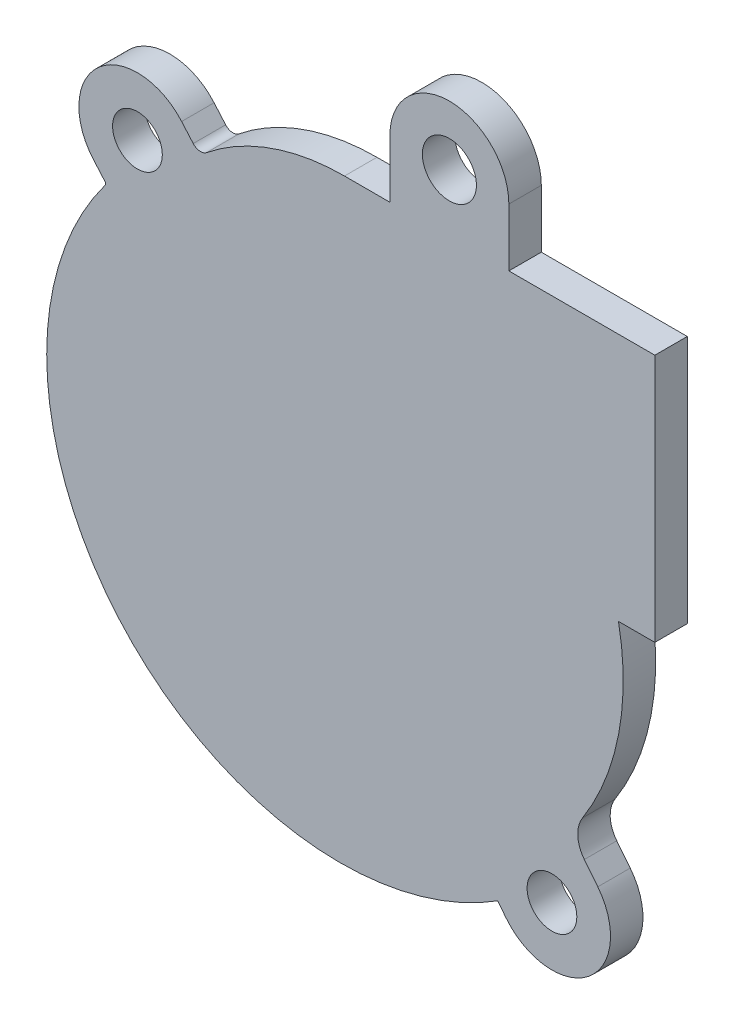
ISO-10303-21;
HEADER;
FILE_DESCRIPTION(('STEP AP214'),'2;1');
FILE_NAME('part.step','',(''),(''),'','','');
FILE_SCHEMA(('AUTOMOTIVE_DESIGN { 1 0 10303 214 1 1 1 1 }'));
ENDSEC;
DATA;
#1=APPLICATION_CONTEXT('core data for automotive mechanical design processes');
#2=APPLICATION_PROTOCOL_DEFINITION('international standard','automotive_design',2000,#1);
#3=PRODUCT_CONTEXT('',#1,'mechanical');
#4=PRODUCT('Part','Part','',(#3));
#5=PRODUCT_RELATED_PRODUCT_CATEGORY('part','',(#4));
#6=PRODUCT_DEFINITION_FORMATION('','',#4);
#7=PRODUCT_DEFINITION_CONTEXT('part definition',#1,'design');
#8=PRODUCT_DEFINITION('design','',#6,#7);
#9=PRODUCT_DEFINITION_SHAPE('','',#8);
#10=(LENGTH_UNIT() NAMED_UNIT(*) SI_UNIT(.MILLI.,.METRE.));
#11=(NAMED_UNIT(*) PLANE_ANGLE_UNIT() SI_UNIT($,.RADIAN.));
#12=(NAMED_UNIT(*) SI_UNIT($,.STERADIAN.) SOLID_ANGLE_UNIT());
#13=UNCERTAINTY_MEASURE_WITH_UNIT(LENGTH_MEASURE(1.E-05),#10,'distance_accuracy_value','');
#14=(GEOMETRIC_REPRESENTATION_CONTEXT(3) GLOBAL_UNCERTAINTY_ASSIGNED_CONTEXT((#13)) GLOBAL_UNIT_ASSIGNED_CONTEXT((#10,
#11,#12)) REPRESENTATION_CONTEXT('',''));
#15=CARTESIAN_POINT('',(0.,0.,0.));
#16=DIRECTION('',(0.,0.,1.));
#17=DIRECTION('',(1.,0.,0.));
#18=AXIS2_PLACEMENT_3D('',#15,#16,#17);
#19=CARTESIAN_POINT('',(-17.,26.3539460861274,3.));
#20=DIRECTION('',(0.,0.,-1.));
#21=DIRECTION('',(-1.,0.,0.));
#22=AXIS2_PLACEMENT_3D('',#19,#20,#21);
#23=PLANE('',#22);
#24=DIRECTION('',(0.,1.,0.));
#25=VECTOR('',#24,1.);
#26=CARTESIAN_POINT('',(-11.5,21.,3.));
#27=LINE('',#26,#25);
#28=CARTESIAN_POINT('',(-11.5,21.,3.));
#29=VERTEX_POINT('',#28);
#30=CARTESIAN_POINT('',(-11.5,26.3539460861274,3.));
#31=VERTEX_POINT('',#30);
#32=EDGE_CURVE('E233',#29,#31,#27,.T.);
#33=ORIENTED_EDGE('',*,*,#32,.T.);
#34=CARTESIAN_POINT('',(-17.,26.3539460861274,3.));
#35=DIRECTION('',(0.,0.,1.));
#36=DIRECTION('',(-1.,0.,0.));
#37=AXIS2_PLACEMENT_3D('',#34,#35,#36);
#38=CIRCLE('',#37,5.5);
#39=CARTESIAN_POINT('',(-22.5,26.3539460861274,3.));
#40=VERTEX_POINT('',#39);
#41=EDGE_CURVE('E125',#31,#40,#38,.T.);
#42=ORIENTED_EDGE('',*,*,#41,.T.);
#43=DIRECTION('',(0.,-1.,0.));
#44=VECTOR('',#43,1.);
#45=CARTESIAN_POINT('',(-22.5,21.,3.));
#46=LINE('',#45,#44);
#47=CARTESIAN_POINT('',(-22.5,21.,3.));
#48=VERTEX_POINT('',#47);
#49=EDGE_CURVE('E281',#40,#48,#46,.T.);
#50=ORIENTED_EDGE('',*,*,#49,.T.);
#51=DIRECTION('',(-1.,0.,0.));
#52=VECTOR('',#51,1.);
#53=CARTESIAN_POINT('',(-26.7,21.,3.));
#54=LINE('',#53,#52);
#55=CARTESIAN_POINT('',(-26.7,21.,3.));
#56=VERTEX_POINT('',#55);
#57=EDGE_CURVE('E300',#48,#56,#54,.T.);
#58=ORIENTED_EDGE('',*,*,#57,.T.);
#59=CARTESIAN_POINT('',(-26.7,0.679356696766886,3.));
#60=DIRECTION('',(0.,0.,1.));
#61=DIRECTION('',(1.,0.,0.));
#62=AXIS2_PLACEMENT_3D('',#59,#60,#61);
#63=CIRCLE('',#62,20.3206433032331);
#64=CARTESIAN_POINT('',(-39.4554144316505,16.4979516702174,3.));
#65=VERTEX_POINT('',#64);
#66=EDGE_CURVE('E297',#56,#65,#63,.T.);
#67=ORIENTED_EDGE('',*,*,#66,.T.);
#68=CARTESIAN_POINT('',(-40.0162603857815,17.19348336293,3.));
#69=DIRECTION('',(0.,0.,-1.));
#70=DIRECTION('',(1.,0.,0.));
#71=AXIS2_PLACEMENT_3D('',#68,#69,#70);
#72=CIRCLE('',#71,0.893483362930042);
#73=CARTESIAN_POINT('',(-40.6905808395545,16.607305535427,3.));
#74=VERTEX_POINT('',#73);
#75=EDGE_CURVE('E299',#65,#74,#72,.T.);
#76=ORIENTED_EDGE('',*,*,#75,.T.);
#77=DIRECTION('',(-0.656059028990513,0.754709580222767,0.));
#78=VECTOR('',#77,1.);
#79=CARTESIAN_POINT('',(-40.6905808395545,16.607305535427,3.));
#80=LINE('',#79,#78);
#81=CARTESIAN_POINT('',(-41.7600244185281,17.8375596419836,3.));
#82=VERTEX_POINT('',#81);
#83=EDGE_CURVE('E302',#74,#82,#80,.T.);
#84=ORIENTED_EDGE('',*,*,#83,.T.);
#85=CARTESIAN_POINT('',(-45.8467767954344,14.285,3.));
#86=DIRECTION('',(0.,0.,1.));
#87=DIRECTION('',(1.,0.,0.));
#88=AXIS2_PLACEMENT_3D('',#85,#86,#87);
#89=CIRCLE('',#88,5.41499999999999);
#90=CARTESIAN_POINT('',(-49.9335291723407,10.7324403580164,3.));
#91=VERTEX_POINT('',#90);
#92=EDGE_CURVE('E308',#82,#91,#89,.T.);
#93=ORIENTED_EDGE('',*,*,#92,.T.);
#94=DIRECTION('',(0.656059028990508,-0.754709580222771,0.));
#95=VECTOR('',#94,1.);
#96=CARTESIAN_POINT('',(-49.9335291723407,10.7324403580164,3.));
#97=LINE('',#96,#95);
#98=CARTESIAN_POINT('',(-48.864085593367,9.50218625145975,3.));
#99=VERTEX_POINT('',#98);
#100=EDGE_CURVE('E310',#91,#99,#97,.T.);
#101=ORIENTED_EDGE('',*,*,#100,.T.);
#102=CARTESIAN_POINT('',(-49.0609857437498,9.33102356205796,3.));
#103=DIRECTION('',(0.,0.,-1.));
#104=DIRECTION('',(1.,0.,0.));
#105=AXIS2_PLACEMENT_3D('',#102,#103,#104);
#106=CIRCLE('',#105,0.260895257649539);
#107=CARTESIAN_POINT('',(-48.8518588134651,9.17503554170481,3.));
#108=VERTEX_POINT('',#107);
#109=EDGE_CURVE('E312',#99,#108,#106,.T.);
#110=ORIENTED_EDGE('',*,*,#109,.T.);
#111=CARTESIAN_POINT('',(-27.0930392290301,-7.05489327509618,3.));
#112=DIRECTION('',(0.,0.,1.));
#113=DIRECTION('',(1.,0.,0.));
#114=AXIS2_PLACEMENT_3D('',#111,#112,#113);
#115=CIRCLE('',#114,27.1451067249038);
#116=CARTESIAN_POINT('',(-12.5384626237151,-29.9682325984344,3.));
#117=VERTEX_POINT('',#116);
#118=EDGE_CURVE('E314',#108,#117,#115,.T.);
#119=ORIENTED_EDGE('',*,*,#118,.T.);
#120=DIRECTION('',(0.622514636637618,-0.782608156852415,0.));
#121=VECTOR('',#120,1.);
#122=CARTESIAN_POINT('',(-12.5384626237151,-29.9682325984344,3.));
#123=LINE('',#122,#121);
#124=CARTESIAN_POINT('',(-11.7528231693558,-30.9559167573927,3.));
#125=VERTEX_POINT('',#124);
#126=EDGE_CURVE('E316',#117,#125,#123,.T.);
#127=ORIENTED_EDGE('',*,*,#126,.T.);
#128=CARTESIAN_POINT('',(-7.515,-27.585,3.));
#129=DIRECTION('',(0.,0.,1.));
#130=DIRECTION('',(1.,0.,0.));
#131=AXIS2_PLACEMENT_3D('',#128,#129,#130);
#132=CIRCLE('',#131,5.415);
#133=CARTESIAN_POINT('',(-3.27717683064417,-24.2140832426073,3.));
#134=VERTEX_POINT('',#133);
#135=EDGE_CURVE('E318',#125,#134,#132,.T.);
#136=ORIENTED_EDGE('',*,*,#135,.T.);
#137=DIRECTION('',(-0.622514636637618,0.782608156852415,0.));
#138=VECTOR('',#137,1.);
#139=CARTESIAN_POINT('',(-3.27717683064417,-24.2140832426073,3.));
#140=LINE('',#139,#138);
#141=CARTESIAN_POINT('',(-4.52220610391941,-22.6488669289025,3.));
#142=VERTEX_POINT('',#141);
#143=EDGE_CURVE('E320',#134,#142,#140,.T.);
#144=ORIENTED_EDGE('',*,*,#143,.T.);
#145=CARTESIAN_POINT('',(-2.3328571379309,-20.9073801272356,3.));
#146=DIRECTION('',(0.,0.,-1.));
#147=DIRECTION('',(1.,0.,0.));
#148=AXIS2_PLACEMENT_3D('',#145,#146,#147);
#149=CIRCLE('',#148,2.79750338252784);
#150=CARTESIAN_POINT('',(-4.68864771655855,-19.3986469086367,3.));
#151=VERTEX_POINT('',#150);
#152=EDGE_CURVE('E322',#142,#151,#149,.T.);
#153=ORIENTED_EDGE('',*,*,#152,.T.);
#154=CARTESIAN_POINT('',(-24.7671678636221,-6.53963872641105,3.));
#155=DIRECTION('',(0.,0.,1.));
#156=DIRECTION('',(1.,0.,0.));
#157=AXIS2_PLACEMENT_3D('',#154,#155,#156);
#158=CIRCLE('',#157,23.8432603208241);
#159=CARTESIAN_POINT('',(-1.36005905112131,-2.,3.));
#160=VERTEX_POINT('',#159);
#161=EDGE_CURVE('E177',#151,#160,#158,.T.);
#162=ORIENTED_EDGE('',*,*,#161,.T.);
#163=DIRECTION('',(1.,0.,0.));
#164=VECTOR('',#163,1.);
#165=CARTESIAN_POINT('',(-1.36005905112131,-2.,3.));
#166=LINE('',#165,#164);
#167=CARTESIAN_POINT('',(2.,-2.,3.));
#168=VERTEX_POINT('',#167);
#169=EDGE_CURVE('E171',#160,#168,#166,.T.);
#170=ORIENTED_EDGE('',*,*,#169,.T.);
#171=DIRECTION('',(0.,1.,0.));
#172=VECTOR('',#171,1.);
#173=CARTESIAN_POINT('',(2.,-2.,3.));
#174=LINE('',#173,#172);
#175=CARTESIAN_POINT('',(2.,21.,3.));
#176=VERTEX_POINT('',#175);
#177=EDGE_CURVE('E175',#168,#176,#174,.T.);
#178=ORIENTED_EDGE('',*,*,#177,.T.);
#179=DIRECTION('',(-1.,0.,0.));
#180=VECTOR('',#179,1.);
#181=CARTESIAN_POINT('',(-11.5,21.,3.));
#182=LINE('',#181,#180);
#183=EDGE_CURVE('E49',#176,#29,#182,.T.);
#184=ORIENTED_EDGE('',*,*,#183,.T.);
#185=EDGE_LOOP('',(#33,#42,#50,#58,#67,#76,#84,#93,#101,#110,#119,#127,#136,#144,#153,#162,#170,
#178,#184));
#186=FACE_BOUND('',#185,.T.);
#187=CARTESIAN_POINT('',(-45.8467767954344,14.285,3.));
#188=DIRECTION('',(0.,0.,1.));
#189=DIRECTION('',(1.,0.,0.));
#190=AXIS2_PLACEMENT_3D('',#187,#188,#189);
#191=CIRCLE('',#190,2.3);
#192=CARTESIAN_POINT('',(-43.5467767954344,14.285,3.));
#193=VERTEX_POINT('',#192);
#194=EDGE_CURVE('E199',#193,#193,#191,.T.);
#195=ORIENTED_EDGE('',*,*,#194,.F.);
#196=EDGE_LOOP('',(#195));
#197=FACE_BOUND('',#196,.T.);
#198=CARTESIAN_POINT('',(-7.515,-27.585,3.));
#199=DIRECTION('',(0.,0.,1.));
#200=DIRECTION('',(1.,0.,0.));
#201=AXIS2_PLACEMENT_3D('',#198,#199,#200);
#202=CIRCLE('',#201,2.3);
#203=CARTESIAN_POINT('',(-5.215,-27.585,3.));
#204=VERTEX_POINT('',#203);
#205=EDGE_CURVE('E376',#204,#204,#202,.T.);
#206=ORIENTED_EDGE('',*,*,#205,.F.);
#207=EDGE_LOOP('',(#206));
#208=FACE_BOUND('',#207,.T.);
#209=CARTESIAN_POINT('',(-17.,26.3539460861274,3.));
#210=DIRECTION('',(0.,0.,1.));
#211=DIRECTION('',(1.,0.,0.));
#212=AXIS2_PLACEMENT_3D('',#209,#210,#211);
#213=CIRCLE('',#212,2.5);
#214=CARTESIAN_POINT('',(-14.5,26.3539460861274,3.));
#215=VERTEX_POINT('',#214);
#216=EDGE_CURVE('E367',#215,#215,#213,.T.);
#217=ORIENTED_EDGE('',*,*,#216,.F.);
#218=EDGE_LOOP('',(#217));
#219=FACE_BOUND('',#218,.T.);
#220=ADVANCED_FACE('F32',(#186,#197,#208,#219),#23,.F.);
#221=CARTESIAN_POINT('',(-17.,26.3539460861274,0.));
#222=DIRECTION('',(0.,0.,-1.));
#223=DIRECTION('',(-1.,0.,0.));
#224=AXIS2_PLACEMENT_3D('',#221,#222,#223);
#225=PLANE('',#224);
#226=CARTESIAN_POINT('',(-7.515,-27.585,0.));
#227=DIRECTION('',(0.,0.,1.));
#228=DIRECTION('',(1.,0.,0.));
#229=AXIS2_PLACEMENT_3D('',#226,#227,#228);
#230=CIRCLE('',#229,2.3);
#231=CARTESIAN_POINT('',(-5.215,-27.585,0.));
#232=VERTEX_POINT('',#231);
#233=EDGE_CURVE('E373',#232,#232,#230,.T.);
#234=ORIENTED_EDGE('',*,*,#233,.T.);
#235=EDGE_LOOP('',(#234));
#236=FACE_BOUND('',#235,.T.);
#237=DIRECTION('',(0.,1.,0.));
#238=VECTOR('',#237,1.);
#239=CARTESIAN_POINT('',(-11.5,21.,0.));
#240=LINE('',#239,#238);
#241=CARTESIAN_POINT('',(-11.5,21.,0.));
#242=VERTEX_POINT('',#241);
#243=CARTESIAN_POINT('',(-11.5,26.3539460861274,0.));
#244=VERTEX_POINT('',#243);
#245=EDGE_CURVE('E195',#242,#244,#240,.T.);
#246=ORIENTED_EDGE('',*,*,#245,.F.);
#247=DIRECTION('',(-1.,0.,0.));
#248=VECTOR('',#247,1.);
#249=CARTESIAN_POINT('',(-11.5,21.,0.));
#250=LINE('',#249,#248);
#251=CARTESIAN_POINT('',(2.,21.,0.));
#252=VERTEX_POINT('',#251);
#253=EDGE_CURVE('E117',#252,#242,#250,.T.);
#254=ORIENTED_EDGE('',*,*,#253,.F.);
#255=DIRECTION('',(0.,1.,0.));
#256=VECTOR('',#255,1.);
#257=CARTESIAN_POINT('',(2.,-2.,0.));
#258=LINE('',#257,#256);
#259=CARTESIAN_POINT('',(2.,-2.,0.));
#260=VERTEX_POINT('',#259);
#261=EDGE_CURVE('E111',#260,#252,#258,.T.);
#262=ORIENTED_EDGE('',*,*,#261,.F.);
#263=DIRECTION('',(1.,0.,0.));
#264=VECTOR('',#263,1.);
#265=CARTESIAN_POINT('',(-1.36005905112131,-2.,0.));
#266=LINE('',#265,#264);
#267=CARTESIAN_POINT('',(-1.36005905112131,-2.,0.));
#268=VERTEX_POINT('',#267);
#269=EDGE_CURVE('E185',#268,#260,#266,.T.);
#270=ORIENTED_EDGE('',*,*,#269,.F.);
#271=CARTESIAN_POINT('',(-24.7671678636221,-6.53963872641105,0.));
#272=DIRECTION('',(0.,0.,1.));
#273=DIRECTION('',(1.,0.,0.));
#274=AXIS2_PLACEMENT_3D('',#271,#272,#273);
#275=CIRCLE('',#274,23.8432603208241);
#276=CARTESIAN_POINT('',(-4.68864771655855,-19.3986469086367,0.));
#277=VERTEX_POINT('',#276);
#278=EDGE_CURVE('E228',#277,#268,#275,.T.);
#279=ORIENTED_EDGE('',*,*,#278,.F.);
#280=CARTESIAN_POINT('',(-2.3328571379309,-20.9073801272356,0.));
#281=DIRECTION('',(0.,0.,-1.));
#282=DIRECTION('',(1.,0.,0.));
#283=AXIS2_PLACEMENT_3D('',#280,#281,#282);
#284=CIRCLE('',#283,2.79750338252784);
#285=CARTESIAN_POINT('',(-4.52220610391941,-22.6488669289025,0.));
#286=VERTEX_POINT('',#285);
#287=EDGE_CURVE('E226',#286,#277,#284,.T.);
#288=ORIENTED_EDGE('',*,*,#287,.F.);
#289=DIRECTION('',(-0.622514636637618,0.782608156852415,0.));
#290=VECTOR('',#289,1.);
#291=CARTESIAN_POINT('',(-3.27717683064417,-24.2140832426073,0.));
#292=LINE('',#291,#290);
#293=CARTESIAN_POINT('',(-3.27717683064417,-24.2140832426073,0.));
#294=VERTEX_POINT('',#293);
#295=EDGE_CURVE('E224',#294,#286,#292,.T.);
#296=ORIENTED_EDGE('',*,*,#295,.F.);
#297=CARTESIAN_POINT('',(-7.515,-27.585,0.));
#298=DIRECTION('',(0.,0.,1.));
#299=DIRECTION('',(1.,0.,0.));
#300=AXIS2_PLACEMENT_3D('',#297,#298,#299);
#301=CIRCLE('',#300,5.415);
#302=CARTESIAN_POINT('',(-11.7528231693558,-30.9559167573927,0.));
#303=VERTEX_POINT('',#302);
#304=EDGE_CURVE('E222',#303,#294,#301,.T.);
#305=ORIENTED_EDGE('',*,*,#304,.F.);
#306=DIRECTION('',(0.622514636637618,-0.782608156852415,0.));
#307=VECTOR('',#306,1.);
#308=CARTESIAN_POINT('',(-12.5384626237151,-29.9682325984344,0.));
#309=LINE('',#308,#307);
#310=CARTESIAN_POINT('',(-12.5384626237151,-29.9682325984344,0.));
#311=VERTEX_POINT('',#310);
#312=EDGE_CURVE('E220',#311,#303,#309,.T.);
#313=ORIENTED_EDGE('',*,*,#312,.F.);
#314=CARTESIAN_POINT('',(-27.0930392290301,-7.05489327509618,0.));
#315=DIRECTION('',(0.,0.,1.));
#316=DIRECTION('',(1.,0.,0.));
#317=AXIS2_PLACEMENT_3D('',#314,#315,#316);
#318=CIRCLE('',#317,27.1451067249038);
#319=CARTESIAN_POINT('',(-48.8518588134651,9.17503554170481,0.));
#320=VERTEX_POINT('',#319);
#321=EDGE_CURVE('E218',#320,#311,#318,.T.);
#322=ORIENTED_EDGE('',*,*,#321,.F.);
#323=CARTESIAN_POINT('',(-49.0609857437498,9.33102356205796,0.));
#324=DIRECTION('',(0.,0.,-1.));
#325=DIRECTION('',(1.,0.,0.));
#326=AXIS2_PLACEMENT_3D('',#323,#324,#325);
#327=CIRCLE('',#326,0.260895257649539);
#328=CARTESIAN_POINT('',(-48.864085593367,9.50218625145975,0.));
#329=VERTEX_POINT('',#328);
#330=EDGE_CURVE('E215',#329,#320,#327,.T.);
#331=ORIENTED_EDGE('',*,*,#330,.F.);
#332=DIRECTION('',(0.656059028990508,-0.754709580222771,0.));
#333=VECTOR('',#332,1.);
#334=CARTESIAN_POINT('',(-49.9335291723407,10.7324403580164,0.));
#335=LINE('',#334,#333);
#336=CARTESIAN_POINT('',(-49.9335291723407,10.7324403580164,0.));
#337=VERTEX_POINT('',#336);
#338=EDGE_CURVE('E213',#337,#329,#335,.T.);
#339=ORIENTED_EDGE('',*,*,#338,.F.);
#340=CARTESIAN_POINT('',(-45.8467767954344,14.285,0.));
#341=DIRECTION('',(0.,0.,1.));
#342=DIRECTION('',(1.,0.,0.));
#343=AXIS2_PLACEMENT_3D('',#340,#341,#342);
#344=CIRCLE('',#343,5.41499999999999);
#345=CARTESIAN_POINT('',(-41.7600244185281,17.8375596419836,0.));
#346=VERTEX_POINT('',#345);
#347=EDGE_CURVE('E211',#346,#337,#344,.T.);
#348=ORIENTED_EDGE('',*,*,#347,.F.);
#349=DIRECTION('',(-0.656059028990513,0.754709580222767,0.));
#350=VECTOR('',#349,1.);
#351=CARTESIAN_POINT('',(-40.6905808395545,16.607305535427,0.));
#352=LINE('',#351,#350);
#353=CARTESIAN_POINT('',(-40.6905808395545,16.607305535427,0.));
#354=VERTEX_POINT('',#353);
#355=EDGE_CURVE('E209',#354,#346,#352,.T.);
#356=ORIENTED_EDGE('',*,*,#355,.F.);
#357=CARTESIAN_POINT('',(-40.0162603857815,17.19348336293,0.));
#358=DIRECTION('',(0.,0.,-1.));
#359=DIRECTION('',(1.,0.,0.));
#360=AXIS2_PLACEMENT_3D('',#357,#358,#359);
#361=CIRCLE('',#360,0.893483362930042);
#362=CARTESIAN_POINT('',(-39.4554144316505,16.4979516702174,0.));
#363=VERTEX_POINT('',#362);
#364=EDGE_CURVE('E207',#363,#354,#361,.T.);
#365=ORIENTED_EDGE('',*,*,#364,.F.);
#366=CARTESIAN_POINT('',(-26.7,0.679356696766886,0.));
#367=DIRECTION('',(0.,0.,1.));
#368=DIRECTION('',(1.,0.,0.));
#369=AXIS2_PLACEMENT_3D('',#366,#367,#368);
#370=CIRCLE('',#369,20.3206433032331);
#371=CARTESIAN_POINT('',(-26.7,21.,0.));
#372=VERTEX_POINT('',#371);
#373=EDGE_CURVE('E205',#372,#363,#370,.T.);
#374=ORIENTED_EDGE('',*,*,#373,.F.);
#375=DIRECTION('',(-1.,0.,0.));
#376=VECTOR('',#375,1.);
#377=CARTESIAN_POINT('',(-26.7,21.,0.));
#378=LINE('',#377,#376);
#379=CARTESIAN_POINT('',(-22.5,21.,0.));
#380=VERTEX_POINT('',#379);
#381=EDGE_CURVE('E203',#380,#372,#378,.T.);
#382=ORIENTED_EDGE('',*,*,#381,.F.);
#383=DIRECTION('',(0.,-1.,0.));
#384=VECTOR('',#383,1.);
#385=CARTESIAN_POINT('',(-22.5,21.,0.));
#386=LINE('',#385,#384);
#387=CARTESIAN_POINT('',(-22.5,26.3539460861274,0.));
#388=VERTEX_POINT('',#387);
#389=EDGE_CURVE('E201',#388,#380,#386,.T.);
#390=ORIENTED_EDGE('',*,*,#389,.F.);
#391=CARTESIAN_POINT('',(-17.,26.3539460861274,0.));
#392=DIRECTION('',(0.,0.,1.));
#393=DIRECTION('',(-1.,0.,0.));
#394=AXIS2_PLACEMENT_3D('',#391,#392,#393);
#395=CIRCLE('',#394,5.5);
#396=EDGE_CURVE('E198',#244,#388,#395,.T.);
#397=ORIENTED_EDGE('',*,*,#396,.F.);
#398=EDGE_LOOP('',(#246,#254,#262,#270,#279,#288,#296,#305,#313,#322,#331,#339,#348,#356,#365,
#374,#382,#390,#397));
#399=FACE_BOUND('',#398,.T.);
#400=CARTESIAN_POINT('',(-45.8467767954344,14.285,0.));
#401=DIRECTION('',(0.,0.,1.));
#402=DIRECTION('',(1.,0.,0.));
#403=AXIS2_PLACEMENT_3D('',#400,#401,#402);
#404=CIRCLE('',#403,2.3);
#405=CARTESIAN_POINT('',(-43.5467767954344,14.285,0.));
#406=VERTEX_POINT('',#405);
#407=EDGE_CURVE('E379',#406,#406,#404,.T.);
#408=ORIENTED_EDGE('',*,*,#407,.T.);
#409=EDGE_LOOP('',(#408));
#410=FACE_BOUND('',#409,.T.);
#411=CARTESIAN_POINT('',(-17.,26.3539460861274,0.));
#412=DIRECTION('',(0.,0.,1.));
#413=DIRECTION('',(1.,0.,0.));
#414=AXIS2_PLACEMENT_3D('',#411,#412,#413);
#415=CIRCLE('',#414,2.5);
#416=CARTESIAN_POINT('',(-14.5,26.3539460861274,0.));
#417=VERTEX_POINT('',#416);
#418=EDGE_CURVE('E370',#417,#417,#415,.T.);
#419=ORIENTED_EDGE('',*,*,#418,.T.);
#420=EDGE_LOOP('',(#419));
#421=FACE_BOUND('',#420,.T.);
#422=ADVANCED_FACE('F285',(#236,#399,#410,#421),#225,.T.);
#423=CARTESIAN_POINT('',(-11.5,21.,3.));
#424=DIRECTION('',(-1.,0.,0.));
#425=DIRECTION('',(0.,0.,1.));
#426=AXIS2_PLACEMENT_3D('',#423,#424,#425);
#427=PLANE('',#426);
#428=ORIENTED_EDGE('',*,*,#245,.T.);
#429=DIRECTION('',(0.,0.,-1.));
#430=VECTOR('',#429,1.);
#431=CARTESIAN_POINT('',(-11.5,26.3539460861274,3.));
#432=LINE('',#431,#430);
#433=EDGE_CURVE('E11',#31,#244,#432,.T.);
#434=ORIENTED_EDGE('',*,*,#433,.F.);
#435=ORIENTED_EDGE('',*,*,#32,.F.);
#436=DIRECTION('',(0.,0.,-1.));
#437=VECTOR('',#436,1.);
#438=CARTESIAN_POINT('',(-11.5,21.,3.));
#439=LINE('',#438,#437);
#440=EDGE_CURVE('E191',#29,#242,#439,.T.);
#441=ORIENTED_EDGE('',*,*,#440,.T.);
#442=EDGE_LOOP('',(#428,#434,#435,#441));
#443=FACE_BOUND('',#442,.T.);
#444=ADVANCED_FACE('F34',(#443),#427,.F.);
#445=CARTESIAN_POINT('',(-17.,26.3539460861274,3.));
#446=DIRECTION('',(0.,0.,-1.));
#447=DIRECTION('',(-1.,0.,0.));
#448=AXIS2_PLACEMENT_3D('',#445,#446,#447);
#449=CYLINDRICAL_SURFACE('',#448,5.5);
#450=ORIENTED_EDGE('',*,*,#396,.T.);
#451=DIRECTION('',(0.,0.,-1.));
#452=VECTOR('',#451,1.);
#453=CARTESIAN_POINT('',(-22.5,26.3539460861274,3.));
#454=LINE('',#453,#452);
#455=EDGE_CURVE('E41',#40,#388,#454,.T.);
#456=ORIENTED_EDGE('',*,*,#455,.F.);
#457=ORIENTED_EDGE('',*,*,#41,.F.);
#458=ORIENTED_EDGE('',*,*,#433,.T.);
#459=EDGE_LOOP('',(#450,#456,#457,#458));
#460=FACE_BOUND('',#459,.T.);
#461=ADVANCED_FACE('F554',(#460),#449,.T.);
#462=CARTESIAN_POINT('',(-22.5,21.,3.));
#463=DIRECTION('',(1.,0.,0.));
#464=DIRECTION('',(0.,0.,-1.));
#465=AXIS2_PLACEMENT_3D('',#462,#463,#464);
#466=PLANE('',#465);
#467=ORIENTED_EDGE('',*,*,#389,.T.);
#468=DIRECTION('',(0.,0.,-1.));
#469=VECTOR('',#468,1.);
#470=CARTESIAN_POINT('',(-22.5,21.,3.));
#471=LINE('',#470,#469);
#472=EDGE_CURVE('E273',#48,#380,#471,.T.);
#473=ORIENTED_EDGE('',*,*,#472,.F.);
#474=ORIENTED_EDGE('',*,*,#49,.F.);
#475=ORIENTED_EDGE('',*,*,#455,.T.);
#476=EDGE_LOOP('',(#467,#473,#474,#475));
#477=FACE_BOUND('',#476,.T.);
#478=ADVANCED_FACE('F279',(#477),#466,.F.);
#479=CARTESIAN_POINT('',(-26.7,21.,3.));
#480=DIRECTION('',(0.,-1.,0.));
#481=DIRECTION('',(1.,0.,0.));
#482=AXIS2_PLACEMENT_3D('',#479,#480,#481);
#483=PLANE('',#482);
#484=ORIENTED_EDGE('',*,*,#381,.T.);
#485=DIRECTION('',(0.,0.,-1.));
#486=VECTOR('',#485,1.);
#487=CARTESIAN_POINT('',(-26.7,21.,3.));
#488=LINE('',#487,#486);
#489=EDGE_CURVE('E270',#56,#372,#488,.T.);
#490=ORIENTED_EDGE('',*,*,#489,.F.);
#491=ORIENTED_EDGE('',*,*,#57,.F.);
#492=ORIENTED_EDGE('',*,*,#472,.T.);
#493=EDGE_LOOP('',(#484,#490,#491,#492));
#494=FACE_BOUND('',#493,.T.);
#495=ADVANCED_FACE('F291',(#494),#483,.F.);
#496=CARTESIAN_POINT('',(-26.7,0.679356696766886,3.));
#497=DIRECTION('',(0.,0.,-1.));
#498=DIRECTION('',(-1.,0.,0.));
#499=AXIS2_PLACEMENT_3D('',#496,#497,#498);
#500=CYLINDRICAL_SURFACE('',#499,20.3206433032331);
#501=ORIENTED_EDGE('',*,*,#373,.T.);
#502=DIRECTION('',(0.,0.,-1.));
#503=VECTOR('',#502,1.);
#504=CARTESIAN_POINT('',(-39.4554144316505,16.4979516702174,3.));
#505=LINE('',#504,#503);
#506=EDGE_CURVE('E267',#65,#363,#505,.T.);
#507=ORIENTED_EDGE('',*,*,#506,.F.);
#508=ORIENTED_EDGE('',*,*,#66,.F.);
#509=ORIENTED_EDGE('',*,*,#489,.T.);
#510=EDGE_LOOP('',(#501,#507,#508,#509));
#511=FACE_BOUND('',#510,.T.);
#512=ADVANCED_FACE('F295',(#511),#500,.T.);
#513=CARTESIAN_POINT('',(-40.0162603857815,17.19348336293,3.));
#514=DIRECTION('',(0.,0.,-1.));
#515=DIRECTION('',(-1.,0.,0.));
#516=AXIS2_PLACEMENT_3D('',#513,#514,#515);
#517=CYLINDRICAL_SURFACE('',#516,0.893483362930042);
#518=ORIENTED_EDGE('',*,*,#364,.T.);
#519=DIRECTION('',(0.,0.,-1.));
#520=VECTOR('',#519,1.);
#521=CARTESIAN_POINT('',(-40.6905808395545,16.607305535427,3.));
#522=LINE('',#521,#520);
#523=EDGE_CURVE('E264',#74,#354,#522,.T.);
#524=ORIENTED_EDGE('',*,*,#523,.F.);
#525=ORIENTED_EDGE('',*,*,#75,.F.);
#526=ORIENTED_EDGE('',*,*,#506,.T.);
#527=EDGE_LOOP('',(#518,#524,#525,#526));
#528=FACE_BOUND('',#527,.T.);
#529=ADVANCED_FACE('F519',(#528),#517,.F.);
#530=CARTESIAN_POINT('',(-40.6905808395545,16.607305535427,3.));
#531=DIRECTION('',(-0.754709580222767,-0.656059028990513,0.));
#532=DIRECTION('',(0.656059028990513,-0.754709580222767,0.));
#533=AXIS2_PLACEMENT_3D('',#530,#531,#532);
#534=PLANE('',#533);
#535=ORIENTED_EDGE('',*,*,#355,.T.);
#536=DIRECTION('',(0.,0.,-1.));
#537=VECTOR('',#536,1.);
#538=CARTESIAN_POINT('',(-41.7600244185281,17.8375596419836,3.));
#539=LINE('',#538,#537);
#540=EDGE_CURVE('E261',#82,#346,#539,.T.);
#541=ORIENTED_EDGE('',*,*,#540,.F.);
#542=ORIENTED_EDGE('',*,*,#83,.F.);
#543=ORIENTED_EDGE('',*,*,#523,.T.);
#544=EDGE_LOOP('',(#535,#541,#542,#543));
#545=FACE_BOUND('',#544,.T.);
#546=ADVANCED_FACE('F509',(#545),#534,.F.);
#547=CARTESIAN_POINT('',(-45.8467767954344,14.285,3.));
#548=DIRECTION('',(0.,0.,-1.));
#549=DIRECTION('',(-1.,0.,0.));
#550=AXIS2_PLACEMENT_3D('',#547,#548,#549);
#551=CYLINDRICAL_SURFACE('',#550,5.41499999999999);
#552=ORIENTED_EDGE('',*,*,#347,.T.);
#553=DIRECTION('',(0.,0.,-1.));
#554=VECTOR('',#553,1.);
#555=CARTESIAN_POINT('',(-49.9335291723407,10.7324403580164,3.));
#556=LINE('',#555,#554);
#557=EDGE_CURVE('E258',#91,#337,#556,.T.);
#558=ORIENTED_EDGE('',*,*,#557,.F.);
#559=ORIENTED_EDGE('',*,*,#92,.F.);
#560=ORIENTED_EDGE('',*,*,#540,.T.);
#561=EDGE_LOOP('',(#552,#558,#559,#560));
#562=FACE_BOUND('',#561,.T.);
#563=ADVANCED_FACE('F499',(#562),#551,.T.);
#564=CARTESIAN_POINT('',(-49.9335291723407,10.7324403580164,3.));
#565=DIRECTION('',(0.754709580222771,0.656059028990508,0.));
#566=DIRECTION('',(-0.656059028990508,0.754709580222771,0.));
#567=AXIS2_PLACEMENT_3D('',#564,#565,#566);
#568=PLANE('',#567);
#569=ORIENTED_EDGE('',*,*,#338,.T.);
#570=DIRECTION('',(0.,0.,-1.));
#571=VECTOR('',#570,1.);
#572=CARTESIAN_POINT('',(-48.864085593367,9.50218625145975,3.));
#573=LINE('',#572,#571);
#574=EDGE_CURVE('E255',#99,#329,#573,.T.);
#575=ORIENTED_EDGE('',*,*,#574,.F.);
#576=ORIENTED_EDGE('',*,*,#100,.F.);
#577=ORIENTED_EDGE('',*,*,#557,.T.);
#578=EDGE_LOOP('',(#569,#575,#576,#577));
#579=FACE_BOUND('',#578,.T.);
#580=ADVANCED_FACE('F488',(#579),#568,.F.);
#581=CARTESIAN_POINT('',(-49.0609857437498,9.33102356205796,3.));
#582=DIRECTION('',(0.,0.,-1.));
#583=DIRECTION('',(-1.,0.,0.));
#584=AXIS2_PLACEMENT_3D('',#581,#582,#583);
#585=CYLINDRICAL_SURFACE('',#584,0.260895257649539);
#586=ORIENTED_EDGE('',*,*,#330,.T.);
#587=DIRECTION('',(0.,0.,-1.));
#588=VECTOR('',#587,1.);
#589=CARTESIAN_POINT('',(-48.8518588134651,9.17503554170481,3.));
#590=LINE('',#589,#588);
#591=EDGE_CURVE('E252',#108,#320,#590,.T.);
#592=ORIENTED_EDGE('',*,*,#591,.F.);
#593=ORIENTED_EDGE('',*,*,#109,.F.);
#594=ORIENTED_EDGE('',*,*,#574,.T.);
#595=EDGE_LOOP('',(#586,#592,#593,#594));
#596=FACE_BOUND('',#595,.T.);
#597=ADVANCED_FACE('F477',(#596),#585,.F.);
#598=CARTESIAN_POINT('',(-27.0930392290301,-7.05489327509618,3.));
#599=DIRECTION('',(0.,0.,-1.));
#600=DIRECTION('',(-1.,0.,0.));
#601=AXIS2_PLACEMENT_3D('',#598,#599,#600);
#602=CYLINDRICAL_SURFACE('',#601,27.1451067249038);
#603=ORIENTED_EDGE('',*,*,#321,.T.);
#604=DIRECTION('',(0.,0.,-1.));
#605=VECTOR('',#604,1.);
#606=CARTESIAN_POINT('',(-12.5384626237151,-29.9682325984344,3.));
#607=LINE('',#606,#605);
#608=EDGE_CURVE('E249',#117,#311,#607,.T.);
#609=ORIENTED_EDGE('',*,*,#608,.F.);
#610=ORIENTED_EDGE('',*,*,#118,.F.);
#611=ORIENTED_EDGE('',*,*,#591,.T.);
#612=EDGE_LOOP('',(#603,#609,#610,#611));
#613=FACE_BOUND('',#612,.T.);
#614=ADVANCED_FACE('F467',(#613),#602,.T.);
#615=CARTESIAN_POINT('',(-12.5384626237151,-29.9682325984344,3.));
#616=DIRECTION('',(0.782608156852415,0.622514636637618,0.));
#617=DIRECTION('',(-0.622514636637618,0.782608156852415,0.));
#618=AXIS2_PLACEMENT_3D('',#615,#616,#617);
#619=PLANE('',#618);
#620=ORIENTED_EDGE('',*,*,#312,.T.);
#621=DIRECTION('',(0.,0.,-1.));
#622=VECTOR('',#621,1.);
#623=CARTESIAN_POINT('',(-11.7528231693558,-30.9559167573927,3.));
#624=LINE('',#623,#622);
#625=EDGE_CURVE('E246',#125,#303,#624,.T.);
#626=ORIENTED_EDGE('',*,*,#625,.F.);
#627=ORIENTED_EDGE('',*,*,#126,.F.);
#628=ORIENTED_EDGE('',*,*,#608,.T.);
#629=EDGE_LOOP('',(#620,#626,#627,#628));
#630=FACE_BOUND('',#629,.T.);
#631=ADVANCED_FACE('F457',(#630),#619,.F.);
#632=CARTESIAN_POINT('',(-7.515,-27.585,3.));
#633=DIRECTION('',(0.,0.,-1.));
#634=DIRECTION('',(-1.,0.,0.));
#635=AXIS2_PLACEMENT_3D('',#632,#633,#634);
#636=CYLINDRICAL_SURFACE('',#635,5.415);
#637=ORIENTED_EDGE('',*,*,#304,.T.);
#638=DIRECTION('',(0.,0.,-1.));
#639=VECTOR('',#638,1.);
#640=CARTESIAN_POINT('',(-3.27717683064417,-24.2140832426073,3.));
#641=LINE('',#640,#639);
#642=EDGE_CURVE('E243',#134,#294,#641,.T.);
#643=ORIENTED_EDGE('',*,*,#642,.F.);
#644=ORIENTED_EDGE('',*,*,#135,.F.);
#645=ORIENTED_EDGE('',*,*,#625,.T.);
#646=EDGE_LOOP('',(#637,#643,#644,#645));
#647=FACE_BOUND('',#646,.T.);
#648=ADVANCED_FACE('F447',(#647),#636,.T.);
#649=CARTESIAN_POINT('',(-3.27717683064417,-24.2140832426073,3.));
#650=DIRECTION('',(-0.782608156852415,-0.622514636637618,0.));
#651=DIRECTION('',(0.622514636637618,-0.782608156852415,0.));
#652=AXIS2_PLACEMENT_3D('',#649,#650,#651);
#653=PLANE('',#652);
#654=ORIENTED_EDGE('',*,*,#295,.T.);
#655=DIRECTION('',(0.,0.,-1.));
#656=VECTOR('',#655,1.);
#657=CARTESIAN_POINT('',(-4.52220610391941,-22.6488669289025,3.));
#658=LINE('',#657,#656);
#659=EDGE_CURVE('E240',#142,#286,#658,.T.);
#660=ORIENTED_EDGE('',*,*,#659,.F.);
#661=ORIENTED_EDGE('',*,*,#143,.F.);
#662=ORIENTED_EDGE('',*,*,#642,.T.);
#663=EDGE_LOOP('',(#654,#660,#661,#662));
#664=FACE_BOUND('',#663,.T.);
#665=ADVANCED_FACE('F438',(#664),#653,.F.);
#666=CARTESIAN_POINT('',(-2.3328571379309,-20.9073801272356,3.));
#667=DIRECTION('',(0.,0.,-1.));
#668=DIRECTION('',(-1.,0.,0.));
#669=AXIS2_PLACEMENT_3D('',#666,#667,#668);
#670=CYLINDRICAL_SURFACE('',#669,2.79750338252784);
#671=ORIENTED_EDGE('',*,*,#287,.T.);
#672=DIRECTION('',(0.,0.,-1.));
#673=VECTOR('',#672,1.);
#674=CARTESIAN_POINT('',(-4.68864771655855,-19.3986469086367,3.));
#675=LINE('',#674,#673);
#676=EDGE_CURVE('E237',#151,#277,#675,.T.);
#677=ORIENTED_EDGE('',*,*,#676,.F.);
#678=ORIENTED_EDGE('',*,*,#152,.F.);
#679=ORIENTED_EDGE('',*,*,#659,.T.);
#680=EDGE_LOOP('',(#671,#677,#678,#679));
#681=FACE_BOUND('',#680,.T.);
#682=ADVANCED_FACE('F328',(#681),#670,.F.);
#683=CARTESIAN_POINT('',(-24.7671678636221,-6.53963872641105,3.));
#684=DIRECTION('',(0.,0.,-1.));
#685=DIRECTION('',(-1.,0.,0.));
#686=AXIS2_PLACEMENT_3D('',#683,#684,#685);
#687=CYLINDRICAL_SURFACE('',#686,23.8432603208241);
#688=ORIENTED_EDGE('',*,*,#278,.T.);
#689=DIRECTION('',(0.,0.,-1.));
#690=VECTOR('',#689,1.);
#691=CARTESIAN_POINT('',(-1.36005905112131,-2.,3.));
#692=LINE('',#691,#690);
#693=EDGE_CURVE('E186',#160,#268,#692,.T.);
#694=ORIENTED_EDGE('',*,*,#693,.F.);
#695=ORIENTED_EDGE('',*,*,#161,.F.);
#696=ORIENTED_EDGE('',*,*,#676,.T.);
#697=EDGE_LOOP('',(#688,#694,#695,#696));
#698=FACE_BOUND('',#697,.T.);
#699=ADVANCED_FACE('F332',(#698),#687,.T.);
#700=CARTESIAN_POINT('',(-1.36005905112131,-2.,3.));
#701=DIRECTION('',(0.,1.,0.));
#702=DIRECTION('',(-1.,0.,0.));
#703=AXIS2_PLACEMENT_3D('',#700,#701,#702);
#704=PLANE('',#703);
#705=ORIENTED_EDGE('',*,*,#269,.T.);
#706=DIRECTION('',(0.,0.,-1.));
#707=VECTOR('',#706,1.);
#708=CARTESIAN_POINT('',(2.,-2.,3.));
#709=LINE('',#708,#707);
#710=EDGE_CURVE('E182',#168,#260,#709,.T.);
#711=ORIENTED_EDGE('',*,*,#710,.F.);
#712=ORIENTED_EDGE('',*,*,#169,.F.);
#713=ORIENTED_EDGE('',*,*,#693,.T.);
#714=EDGE_LOOP('',(#705,#711,#712,#713));
#715=FACE_BOUND('',#714,.T.);
#716=ADVANCED_FACE('F183',(#715),#704,.F.);
#717=CARTESIAN_POINT('',(2.,-2.,3.));
#718=DIRECTION('',(-1.,0.,0.));
#719=DIRECTION('',(0.,-1.,0.));
#720=AXIS2_PLACEMENT_3D('',#717,#718,#719);
#721=PLANE('',#720);
#722=ORIENTED_EDGE('',*,*,#261,.T.);
#723=DIRECTION('',(0.,0.,-1.));
#724=VECTOR('',#723,1.);
#725=CARTESIAN_POINT('',(2.,21.,3.));
#726=LINE('',#725,#724);
#727=EDGE_CURVE('E187',#176,#252,#726,.T.);
#728=ORIENTED_EDGE('',*,*,#727,.F.);
#729=ORIENTED_EDGE('',*,*,#177,.F.);
#730=ORIENTED_EDGE('',*,*,#710,.T.);
#731=EDGE_LOOP('',(#722,#728,#729,#730));
#732=FACE_BOUND('',#731,.T.);
#733=ADVANCED_FACE('F189',(#732),#721,.F.);
#734=CARTESIAN_POINT('',(-11.5,21.,3.));
#735=DIRECTION('',(0.,-1.,0.));
#736=DIRECTION('',(1.,0.,0.));
#737=AXIS2_PLACEMENT_3D('',#734,#735,#736);
#738=PLANE('',#737);
#739=ORIENTED_EDGE('',*,*,#253,.T.);
#740=ORIENTED_EDGE('',*,*,#440,.F.);
#741=ORIENTED_EDGE('',*,*,#183,.F.);
#742=ORIENTED_EDGE('',*,*,#727,.T.);
#743=EDGE_LOOP('',(#739,#740,#741,#742));
#744=FACE_BOUND('',#743,.T.);
#745=ADVANCED_FACE('F336',(#744),#738,.F.);
#746=CARTESIAN_POINT('',(-45.8467767954344,14.285,3.));
#747=DIRECTION('',(0.,0.,-1.));
#748=DIRECTION('',(-1.,0.,0.));
#749=AXIS2_PLACEMENT_3D('',#746,#747,#748);
#750=CYLINDRICAL_SURFACE('',#749,2.3);
#751=ORIENTED_EDGE('',*,*,#194,.T.);
#752=EDGE_LOOP('',(#751));
#753=FACE_BOUND('',#752,.T.);
#754=ORIENTED_EDGE('',*,*,#407,.F.);
#755=EDGE_LOOP('',(#754));
#756=FACE_BOUND('',#755,.T.);
#757=ADVANCED_FACE('F338',(#753,#756),#750,.F.);
#758=CARTESIAN_POINT('',(-7.515,-27.585,3.));
#759=DIRECTION('',(0.,0.,-1.));
#760=DIRECTION('',(-1.,0.,0.));
#761=AXIS2_PLACEMENT_3D('',#758,#759,#760);
#762=CYLINDRICAL_SURFACE('',#761,2.3);
#763=ORIENTED_EDGE('',*,*,#205,.T.);
#764=EDGE_LOOP('',(#763));
#765=FACE_BOUND('',#764,.T.);
#766=ORIENTED_EDGE('',*,*,#233,.F.);
#767=EDGE_LOOP('',(#766));
#768=FACE_BOUND('',#767,.T.);
#769=ADVANCED_FACE('F344',(#765,#768),#762,.F.);
#770=CARTESIAN_POINT('',(-17.,26.3539460861274,3.));
#771=DIRECTION('',(0.,0.,-1.));
#772=DIRECTION('',(-1.,0.,0.));
#773=AXIS2_PLACEMENT_3D('',#770,#771,#772);
#774=CYLINDRICAL_SURFACE('',#773,2.5);
#775=ORIENTED_EDGE('',*,*,#216,.T.);
#776=EDGE_LOOP('',(#775));
#777=FACE_BOUND('',#776,.T.);
#778=ORIENTED_EDGE('',*,*,#418,.F.);
#779=EDGE_LOOP('',(#778));
#780=FACE_BOUND('',#779,.T.);
#781=ADVANCED_FACE('F358',(#777,#780),#774,.F.);
#782=CLOSED_SHELL('',(#220,#422,#444,#461,#478,#495,#512,#529,#546,#563,#580,#597,#614,#631,
#648,#665,#682,#699,#716,#733,#745,#757,#769,#781));
#783=MANIFOLD_SOLID_BREP('B2',#782);
#784=ADVANCED_BREP_SHAPE_REPRESENTATION('',(#18,#783),#14);
#785=SHAPE_DEFINITION_REPRESENTATION(#9,#784);
ENDSEC;
END-ISO-10303-21;
